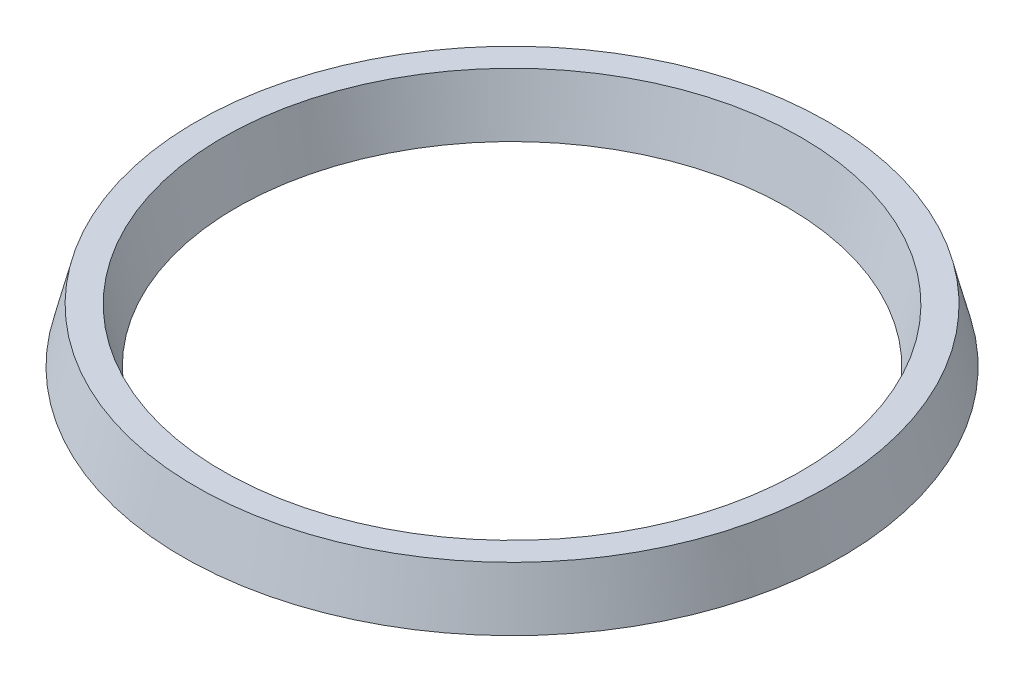
ISO-10303-21;
HEADER;
FILE_DESCRIPTION(('STEP AP214'),'2;1');
FILE_NAME('part.step','',(''),(''),'','','');
FILE_SCHEMA(('AUTOMOTIVE_DESIGN { 1 0 10303 214 1 1 1 1 }'));
ENDSEC;
DATA;
#1=APPLICATION_CONTEXT('core data for automotive mechanical design processes');
#2=APPLICATION_PROTOCOL_DEFINITION('international standard','automotive_design',2000,#1);
#3=PRODUCT_CONTEXT('',#1,'mechanical');
#4=PRODUCT('Part','Part','',(#3));
#5=PRODUCT_RELATED_PRODUCT_CATEGORY('part','',(#4));
#6=PRODUCT_DEFINITION_FORMATION('','',#4);
#7=PRODUCT_DEFINITION_CONTEXT('part definition',#1,'design');
#8=PRODUCT_DEFINITION('design','',#6,#7);
#9=PRODUCT_DEFINITION_SHAPE('','',#8);
#10=(LENGTH_UNIT() NAMED_UNIT(*) SI_UNIT(.MILLI.,.METRE.));
#11=(NAMED_UNIT(*) PLANE_ANGLE_UNIT() SI_UNIT($,.RADIAN.));
#12=(NAMED_UNIT(*) SI_UNIT($,.STERADIAN.) SOLID_ANGLE_UNIT());
#13=UNCERTAINTY_MEASURE_WITH_UNIT(LENGTH_MEASURE(1.E-05),#10,'distance_accuracy_value','');
#14=(GEOMETRIC_REPRESENTATION_CONTEXT(3) GLOBAL_UNCERTAINTY_ASSIGNED_CONTEXT((#13)) GLOBAL_UNIT_ASSIGNED_CONTEXT((#10,
#11,#12)) REPRESENTATION_CONTEXT('',''));
#15=CARTESIAN_POINT('',(0.,0.,0.));
#16=DIRECTION('',(0.,0.,1.));
#17=DIRECTION('',(1.,0.,0.));
#18=AXIS2_PLACEMENT_3D('',#15,#16,#17);
#19=CARTESIAN_POINT('',(-67.31,-6.,0.));
#20=DIRECTION('',(0.,-1.,0.));
#21=DIRECTION('',(0.,0.,-1.));
#22=AXIS2_PLACEMENT_3D('',#19,#20,#21);
#23=CONICAL_SURFACE('',#22,73.31,0.244978663126864);
#24=CARTESIAN_POINT('',(-67.31,6.,0.));
#25=DIRECTION('',(0.,-1.,0.));
#26=DIRECTION('',(0.,0.,-1.));
#27=AXIS2_PLACEMENT_3D('',#24,#25,#26);
#28=CIRCLE('',#27,70.31);
#29=CARTESIAN_POINT('',(-67.31,6.,-70.31));
#30=VERTEX_POINT('',#29);
#31=EDGE_CURVE('E59',#30,#30,#28,.T.);
#32=ORIENTED_EDGE('',*,*,#31,.T.);
#33=EDGE_LOOP('',(#32));
#34=FACE_BOUND('',#33,.T.);
#35=CARTESIAN_POINT('',(-67.31,-6.,0.));
#36=DIRECTION('',(0.,-1.,0.));
#37=DIRECTION('',(0.,0.,-1.));
#38=AXIS2_PLACEMENT_3D('',#35,#36,#37);
#39=CIRCLE('',#38,73.31);
#40=CARTESIAN_POINT('',(-67.31,-6.,-73.31));
#41=VERTEX_POINT('',#40);
#42=EDGE_CURVE('E10',#41,#41,#39,.T.);
#43=ORIENTED_EDGE('',*,*,#42,.F.);
#44=EDGE_LOOP('',(#43));
#45=FACE_BOUND('',#44,.T.);
#46=ADVANCED_FACE('F31',(#34,#45),#23,.T.);
#47=CARTESIAN_POINT('',(3.,-6.,0.));
#48=DIRECTION('',(0.,-1.,0.));
#49=DIRECTION('',(0.,0.,-1.));
#50=AXIS2_PLACEMENT_3D('',#47,#48,#49);
#51=PLANE('',#50);
#52=ORIENTED_EDGE('',*,*,#42,.T.);
#53=EDGE_LOOP('',(#52));
#54=FACE_BOUND('',#53,.T.);
#55=CARTESIAN_POINT('',(-67.31,-6.,0.));
#56=DIRECTION('',(0.,-1.,0.));
#57=DIRECTION('',(0.,0.,-1.));
#58=AXIS2_PLACEMENT_3D('',#55,#56,#57);
#59=CIRCLE('',#58,70.31);
#60=CARTESIAN_POINT('',(-67.31,-6.,-70.31));
#61=VERTEX_POINT('',#60);
#62=EDGE_CURVE('E37',#61,#61,#59,.T.);
#63=ORIENTED_EDGE('',*,*,#62,.F.);
#64=EDGE_LOOP('',(#63));
#65=FACE_BOUND('',#64,.T.);
#66=ADVANCED_FACE('F77',(#54,#65),#51,.T.);
#67=CARTESIAN_POINT('',(-67.31,-1.455213750218,0.));
#68=DIRECTION('',(0.,-1.,0.));
#69=DIRECTION('',(0.,0.,-1.));
#70=AXIS2_PLACEMENT_3D('',#67,#68,#69);
#71=CONICAL_SURFACE('',#70,69.1738034375545,0.244978663126864);
#72=ORIENTED_EDGE('',*,*,#62,.T.);
#73=EDGE_LOOP('',(#72));
#74=FACE_BOUND('',#73,.T.);
#75=CARTESIAN_POINT('',(-67.31,-1.455213750218,0.));
#76=DIRECTION('',(0.,-1.,0.));
#77=DIRECTION('',(0.,0.,-1.));
#78=AXIS2_PLACEMENT_3D('',#75,#76,#77);
#79=CIRCLE('',#78,69.1738034375545);
#80=CARTESIAN_POINT('',(-67.31,-1.455213750218,-69.1738034375545));
#81=VERTEX_POINT('',#80);
#82=EDGE_CURVE('E41',#81,#81,#79,.T.);
#83=ORIENTED_EDGE('',*,*,#82,.F.);
#84=EDGE_LOOP('',(#83));
#85=FACE_BOUND('',#84,.T.);
#86=ADVANCED_FACE('F81',(#74,#85),#71,.F.);
#87=CARTESIAN_POINT('',(-67.31,-1.92116460960662,0.));
#88=DIRECTION('',(0.,-1.,0.));
#89=DIRECTION('',(0.,0.,-1.));
#90=AXIS2_PLACEMENT_3D('',#87,#88,#89);
#91=TOROIDAL_SURFACE('',#90,67.31,1.92116460960662);
#92=ORIENTED_EDGE('',*,*,#82,.T.);
#93=EDGE_LOOP('',(#92));
#94=FACE_BOUND('',#93,.T.);
#95=CARTESIAN_POINT('',(-67.31,-1.455213750218,0.));
#96=DIRECTION('',(0.,-1.,0.));
#97=DIRECTION('',(0.,0.,-1.));
#98=AXIS2_PLACEMENT_3D('',#95,#96,#97);
#99=CIRCLE('',#98,65.4461965624455);
#100=CARTESIAN_POINT('',(-67.31,-1.455213750218,-65.4461965624455));
#101=VERTEX_POINT('',#100);
#102=EDGE_CURVE('E45',#101,#101,#99,.T.);
#103=ORIENTED_EDGE('',*,*,#102,.F.);
#104=EDGE_LOOP('',(#103));
#105=FACE_BOUND('',#104,.T.);
#106=ADVANCED_FACE('F85',(#94,#105),#91,.F.);
#107=CARTESIAN_POINT('',(-67.31,-6.,0.));
#108=DIRECTION('',(0.,1.,0.));
#109=DIRECTION('',(0.,0.,1.));
#110=AXIS2_PLACEMENT_3D('',#107,#108,#109);
#111=CONICAL_SURFACE('',#110,64.31,0.244978663126864);
#112=ORIENTED_EDGE('',*,*,#102,.T.);
#113=EDGE_LOOP('',(#112));
#114=FACE_BOUND('',#113,.T.);
#115=CARTESIAN_POINT('',(-67.31,-6.,0.));
#116=DIRECTION('',(0.,-1.,0.));
#117=DIRECTION('',(0.,0.,-1.));
#118=AXIS2_PLACEMENT_3D('',#115,#116,#117);
#119=CIRCLE('',#118,64.31);
#120=CARTESIAN_POINT('',(-67.31,-6.,-64.31));
#121=VERTEX_POINT('',#120);
#122=EDGE_CURVE('E50',#121,#121,#119,.T.);
#123=ORIENTED_EDGE('',*,*,#122,.F.);
#124=EDGE_LOOP('',(#123));
#125=FACE_BOUND('',#124,.T.);
#126=ADVANCED_FACE('F91',(#114,#125),#111,.T.);
#127=CARTESIAN_POINT('',(-6.,-6.,0.));
#128=DIRECTION('',(0.,-1.,0.));
#129=DIRECTION('',(0.,0.,-1.));
#130=AXIS2_PLACEMENT_3D('',#127,#128,#129);
#131=PLANE('',#130);
#132=ORIENTED_EDGE('',*,*,#122,.T.);
#133=EDGE_LOOP('',(#132));
#134=FACE_BOUND('',#133,.T.);
#135=CARTESIAN_POINT('',(-67.31,-6.,0.));
#136=DIRECTION('',(0.,-1.,0.));
#137=DIRECTION('',(0.,0.,-1.));
#138=AXIS2_PLACEMENT_3D('',#135,#136,#137);
#139=CIRCLE('',#138,61.31);
#140=CARTESIAN_POINT('',(-67.31,-6.,-61.31));
#141=VERTEX_POINT('',#140);
#142=EDGE_CURVE('E53',#141,#141,#139,.T.);
#143=ORIENTED_EDGE('',*,*,#142,.F.);
#144=EDGE_LOOP('',(#143));
#145=FACE_BOUND('',#144,.T.);
#146=ADVANCED_FACE('F73',(#134,#145),#131,.T.);
#147=CARTESIAN_POINT('',(-67.31,6.,0.));
#148=DIRECTION('',(0.,1.,0.));
#149=DIRECTION('',(0.,0.,1.));
#150=AXIS2_PLACEMENT_3D('',#147,#148,#149);
#151=CONICAL_SURFACE('',#150,64.31,0.244978663126864);
#152=ORIENTED_EDGE('',*,*,#142,.T.);
#153=EDGE_LOOP('',(#152));
#154=FACE_BOUND('',#153,.T.);
#155=CARTESIAN_POINT('',(-67.31,6.,0.));
#156=DIRECTION('',(0.,-1.,0.));
#157=DIRECTION('',(0.,0.,-1.));
#158=AXIS2_PLACEMENT_3D('',#155,#156,#157);
#159=CIRCLE('',#158,64.31);
#160=CARTESIAN_POINT('',(-67.31,6.,-64.31));
#161=VERTEX_POINT('',#160);
#162=EDGE_CURVE('E56',#161,#161,#159,.T.);
#163=ORIENTED_EDGE('',*,*,#162,.F.);
#164=EDGE_LOOP('',(#163));
#165=FACE_BOUND('',#164,.T.);
#166=ADVANCED_FACE('F67',(#154,#165),#151,.F.);
#167=CARTESIAN_POINT('',(3.,6.,0.));
#168=DIRECTION('',(0.,1.,0.));
#169=DIRECTION('',(0.,0.,1.));
#170=AXIS2_PLACEMENT_3D('',#167,#168,#169);
#171=PLANE('',#170);
#172=ORIENTED_EDGE('',*,*,#162,.T.);
#173=EDGE_LOOP('',(#172));
#174=FACE_BOUND('',#173,.T.);
#175=ORIENTED_EDGE('',*,*,#31,.F.);
#176=EDGE_LOOP('',(#175));
#177=FACE_BOUND('',#176,.T.);
#178=ADVANCED_FACE('F65',(#174,#177),#171,.T.);
#179=CLOSED_SHELL('',(#46,#66,#86,#106,#126,#146,#166,#178));
#180=MANIFOLD_SOLID_BREP('B2',#179);
#181=ADVANCED_BREP_SHAPE_REPRESENTATION('',(#18,#180),#14);
#182=SHAPE_DEFINITION_REPRESENTATION(#9,#181);
ENDSEC;
END-ISO-10303-21;
